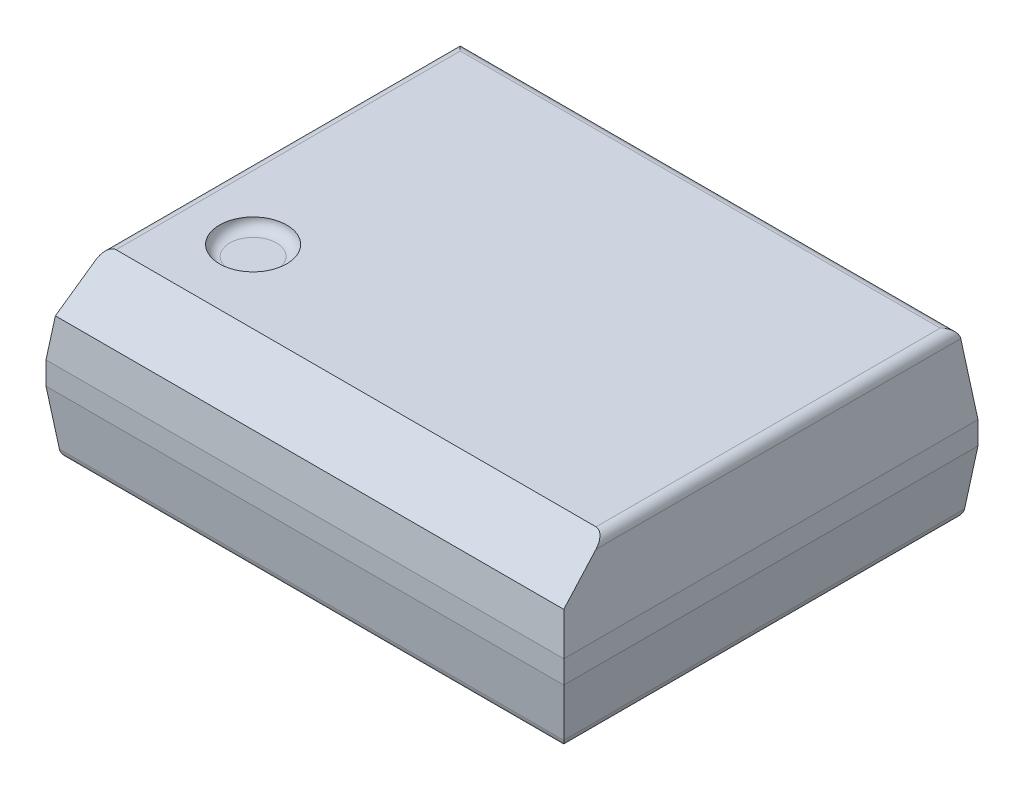
ISO-10303-21;
HEADER;
FILE_DESCRIPTION(('STEP AP214'),'2;1');
FILE_NAME('part.step','',(''),(''),'','','');
FILE_SCHEMA(('AUTOMOTIVE_DESIGN { 1 0 10303 214 1 1 1 1 }'));
ENDSEC;
DATA;
#1=APPLICATION_CONTEXT('core data for automotive mechanical design processes');
#2=APPLICATION_PROTOCOL_DEFINITION('international standard','automotive_design',2000,#1);
#3=PRODUCT_CONTEXT('',#1,'mechanical');
#4=PRODUCT('Part','Part','',(#3));
#5=PRODUCT_RELATED_PRODUCT_CATEGORY('part','',(#4));
#6=PRODUCT_DEFINITION_FORMATION('','',#4);
#7=PRODUCT_DEFINITION_CONTEXT('part definition',#1,'design');
#8=PRODUCT_DEFINITION('design','',#6,#7);
#9=PRODUCT_DEFINITION_SHAPE('','',#8);
#10=(LENGTH_UNIT() NAMED_UNIT(*) SI_UNIT(.MILLI.,.METRE.));
#11=(NAMED_UNIT(*) PLANE_ANGLE_UNIT() SI_UNIT($,.RADIAN.));
#12=(NAMED_UNIT(*) SI_UNIT($,.STERADIAN.) SOLID_ANGLE_UNIT());
#13=UNCERTAINTY_MEASURE_WITH_UNIT(LENGTH_MEASURE(1.E-05),#10,'distance_accuracy_value','');
#14=(GEOMETRIC_REPRESENTATION_CONTEXT(3) GLOBAL_UNCERTAINTY_ASSIGNED_CONTEXT((#13)) GLOBAL_UNIT_ASSIGNED_CONTEXT((#10,
#11,#12)) REPRESENTATION_CONTEXT('',''));
#15=CARTESIAN_POINT('',(0.,0.,0.));
#16=DIRECTION('',(0.,0.,1.));
#17=DIRECTION('',(1.,0.,0.));
#18=AXIS2_PLACEMENT_3D('',#15,#16,#17);
#19=CARTESIAN_POINT('',(-1.7,1.65,0.8));
#20=DIRECTION('',(0.,1.,0.));
#21=DIRECTION('',(0.,0.,1.));
#22=AXIS2_PLACEMENT_3D('',#19,#20,#21);
#23=PLANE('',#22);
#24=CARTESIAN_POINT('',(-1.7,1.65,0.8));
#25=DIRECTION('',(0.,1.,0.));
#26=DIRECTION('',(0.,0.,1.));
#27=AXIS2_PLACEMENT_3D('',#24,#25,#26);
#28=CIRCLE('',#27,0.225000000000001);
#29=CARTESIAN_POINT('',(-1.7,1.65,1.025));
#30=VERTEX_POINT('',#29);
#31=EDGE_CURVE('E20',#30,#30,#28,.T.);
#32=ORIENTED_EDGE('',*,*,#31,.T.);
#33=EDGE_LOOP('',(#32));
#34=FACE_BOUND('',#33,.T.);
#35=ADVANCED_FACE('F16',(#34),#23,.T.);
#36=CARTESIAN_POINT('',(-1.7,1.75,0.8));
#37=DIRECTION('',(0.,1.,0.));
#38=DIRECTION('',(0.,0.,1.));
#39=AXIS2_PLACEMENT_3D('',#36,#37,#38);
#40=TOROIDAL_SURFACE('',#39,0.225000000000001,0.0999999999999994);
#41=ORIENTED_EDGE('',*,*,#31,.F.);
#42=EDGE_LOOP('',(#41));
#43=FACE_BOUND('',#42,.T.);
#44=CARTESIAN_POINT('',(-1.7,1.75,0.8));
#45=DIRECTION('',(0.,1.,0.));
#46=DIRECTION('',(0.,0.,1.));
#47=AXIS2_PLACEMENT_3D('',#44,#45,#46);
#48=CIRCLE('',#47,0.325);
#49=CARTESIAN_POINT('',(-1.7,1.75,1.125));
#50=VERTEX_POINT('',#49);
#51=EDGE_CURVE('E100',#50,#50,#48,.F.);
#52=ORIENTED_EDGE('',*,*,#51,.F.);
#53=EDGE_LOOP('',(#52));
#54=FACE_BOUND('',#53,.T.);
#55=ADVANCED_FACE('F18',(#43,#54),#40,.F.);
#56=CARTESIAN_POINT('',(0.,1.75,0.));
#57=DIRECTION('',(0.,1.,0.));
#58=DIRECTION('',(0.,0.,1.));
#59=AXIS2_PLACEMENT_3D('',#56,#57,#58);
#60=PLANE('',#59);
#61=ORIENTED_EDGE('',*,*,#51,.T.);
#62=EDGE_LOOP('',(#61));
#63=FACE_BOUND('',#62,.T.);
#64=DIRECTION('',(0.,0.,-1.));
#65=VECTOR('',#64,1.);
#66=CARTESIAN_POINT('',(-2.31759728445368,1.75,0.));
#67=LINE('',#66,#65);
#68=CARTESIAN_POINT('',(-2.31759728445368,1.75,1.50606981090928));
#69=VERTEX_POINT('',#68);
#70=CARTESIAN_POINT('',(-2.31759728445368,1.75,-1.81759728445368));
#71=VERTEX_POINT('',#70);
#72=EDGE_CURVE('E92',#69,#71,#67,.T.);
#73=ORIENTED_EDGE('',*,*,#72,.F.);
#74=DIRECTION('',(1.,0.,0.));
#75=VECTOR('',#74,1.);
#76=CARTESIAN_POINT('',(0.,1.75,1.50606981090928));
#77=LINE('',#76,#75);
#78=CARTESIAN_POINT('',(2.31759728445368,1.75,1.50606981090928));
#79=VERTEX_POINT('',#78);
#80=EDGE_CURVE('E80',#79,#69,#77,.F.);
#81=ORIENTED_EDGE('',*,*,#80,.F.);
#82=DIRECTION('',(0.,0.,1.));
#83=VECTOR('',#82,1.);
#84=CARTESIAN_POINT('',(2.31759728445368,1.75,0.));
#85=LINE('',#84,#83);
#86=CARTESIAN_POINT('',(2.31759728445368,1.75,-1.81759728445368));
#87=VERTEX_POINT('',#86);
#88=EDGE_CURVE('E107',#87,#79,#85,.T.);
#89=ORIENTED_EDGE('',*,*,#88,.F.);
#90=DIRECTION('',(1.,0.,0.));
#91=VECTOR('',#90,1.);
#92=CARTESIAN_POINT('',(0.,1.75,-1.81759728445368));
#93=LINE('',#92,#91);
#94=EDGE_CURVE('E96',#71,#87,#93,.T.);
#95=ORIENTED_EDGE('',*,*,#94,.F.);
#96=EDGE_LOOP('',(#73,#81,#89,#95));
#97=FACE_BOUND('',#96,.T.);
#98=ADVANCED_FACE('F95',(#63,#97),#60,.T.);
#99=CARTESIAN_POINT('',(-2.31759728445368,1.65,0.));
#100=DIRECTION('',(0.,0.,-1.));
#101=DIRECTION('',(0.,1.,0.));
#102=AXIS2_PLACEMENT_3D('',#99,#100,#101);
#103=CYLINDRICAL_SURFACE('',#102,0.1);
#104=CARTESIAN_POINT('',(-2.31759728445368,1.65,1.61909924954546));
#105=DIRECTION('',(0.,0.748955720789002,0.662620048215738));
#106=DIRECTION('',(0.,0.662620048215738,-0.748955720789002));
#107=AXIS2_PLACEMENT_3D('',#104,#105,#106);
#108=ELLIPSE('',#107,0.150916049505707,0.1);
#109=CARTESIAN_POINT('',(-2.41685189961781,1.66218693434051,1.60532442607342));
#110=VERTEX_POINT('',#109);
#111=EDGE_CURVE('E86',#69,#110,#108,.T.);
#112=ORIENTED_EDGE('',*,*,#111,.F.);
#113=ORIENTED_EDGE('',*,*,#72,.T.);
#114=CARTESIAN_POINT('',(-2.31759728445368,1.65,-1.81759728445368));
#115=DIRECTION('',(0.707106781186547,0.,-0.707106781186547));
#116=DIRECTION('',(0.707106781186547,0.,0.707106781186547));
#117=AXIS2_PLACEMENT_3D('',#114,#115,#116);
#118=ELLIPSE('',#117,0.14142135623731,0.1);
#119=CARTESIAN_POINT('',(-2.41685189961781,1.66218693434051,-1.91685189961781));
#120=VERTEX_POINT('',#119);
#121=EDGE_CURVE('E441',#120,#71,#118,.T.);
#122=ORIENTED_EDGE('',*,*,#121,.F.);
#123=DIRECTION('',(0.,0.,1.));
#124=VECTOR('',#123,1.);
#125=CARTESIAN_POINT('',(-2.41685189961782,1.66218693434051,0.));
#126=LINE('',#125,#124);
#127=EDGE_CURVE('E104',#110,#120,#126,.F.);
#128=ORIENTED_EDGE('',*,*,#127,.F.);
#129=EDGE_LOOP('',(#112,#113,#122,#128));
#130=FACE_BOUND('',#129,.T.);
#131=ADVANCED_FACE('F103',(#130),#103,.T.);
#132=CARTESIAN_POINT('',(0.,1.55149076967174,1.73044367959031));
#133=DIRECTION('',(0.,0.748955720789002,0.662620048215738));
#134=DIRECTION('',(0.,-0.662620048215738,0.748955720789002));
#135=AXIS2_PLACEMENT_3D('',#132,#133,#134);
#136=PLANE('',#135);
#137=DIRECTION('',(1.,0.,0.));
#138=VECTOR('',#137,1.);
#139=CARTESIAN_POINT('',(0.,1.35298153934347,1.95481754827134));
#140=LINE('',#139,#138);
#141=CARTESIAN_POINT('',(2.45481754827134,1.35298153934347,1.95481754827134));
#142=VERTEX_POINT('',#141);
#143=CARTESIAN_POINT('',(-2.45481754827134,1.35298153934347,1.95481754827134));
#144=VERTEX_POINT('',#143);
#145=EDGE_CURVE('E453',#142,#144,#140,.F.);
#146=ORIENTED_EDGE('',*,*,#145,.F.);
#147=DIRECTION('',(-0.0810915667930045,0.660437812349415,-0.746489151839579));
#148=VECTOR('',#147,1.);
#149=CARTESIAN_POINT('',(2.45481754827134,1.35298153934347,1.95481754827134));
#150=LINE('',#149,#148);
#151=CARTESIAN_POINT('',(2.41685189961781,1.66218693434051,1.60532442607342));
#152=VERTEX_POINT('',#151);
#153=EDGE_CURVE('E105',#142,#152,#150,.T.);
#154=ORIENTED_EDGE('',*,*,#153,.T.);
#155=CARTESIAN_POINT('',(2.31759728445368,1.65,1.61909924954546));
#156=DIRECTION('',(0.,0.748955720789002,0.662620048215738));
#157=DIRECTION('',(0.,-0.662620048215738,0.748955720789002));
#158=AXIS2_PLACEMENT_3D('',#155,#156,#157);
#159=ELLIPSE('',#158,0.150916049505707,0.1);
#160=EDGE_CURVE('E89',#79,#152,#159,.F.);
#161=ORIENTED_EDGE('',*,*,#160,.F.);
#162=ORIENTED_EDGE('',*,*,#80,.T.);
#163=ORIENTED_EDGE('',*,*,#111,.T.);
#164=DIRECTION('',(0.081091566792998,0.660437812349421,-0.746489151839575));
#165=VECTOR('',#164,1.);
#166=CARTESIAN_POINT('',(-2.45481754827134,1.35298153934347,1.95481754827134));
#167=LINE('',#166,#165);
#168=EDGE_CURVE('E464',#144,#110,#167,.T.);
#169=ORIENTED_EDGE('',*,*,#168,.F.);
#170=EDGE_LOOP('',(#146,#154,#161,#162,#163,#169));
#171=FACE_BOUND('',#170,.T.);
#172=ADVANCED_FACE('F83',(#171),#136,.T.);
#173=CARTESIAN_POINT('',(2.31759728445368,1.65,0.));
#174=DIRECTION('',(0.,0.,1.));
#175=DIRECTION('',(0.,-1.,0.));
#176=AXIS2_PLACEMENT_3D('',#173,#174,#175);
#177=CYLINDRICAL_SURFACE('',#176,0.1);
#178=ORIENTED_EDGE('',*,*,#160,.T.);
#179=DIRECTION('',(0.,0.,1.));
#180=VECTOR('',#179,1.);
#181=CARTESIAN_POINT('',(2.41685189961782,1.66218693434051,0.));
#182=LINE('',#181,#180);
#183=CARTESIAN_POINT('',(2.41685189961781,1.66218693434051,-1.91685189961781));
#184=VERTEX_POINT('',#183);
#185=EDGE_CURVE('E439',#184,#152,#182,.T.);
#186=ORIENTED_EDGE('',*,*,#185,.F.);
#187=CARTESIAN_POINT('',(2.31759728445368,1.65,-1.81759728445368));
#188=DIRECTION('',(0.707106781186547,0.,0.707106781186547));
#189=DIRECTION('',(0.707106781186547,0.,-0.707106781186547));
#190=AXIS2_PLACEMENT_3D('',#187,#188,#189);
#191=ELLIPSE('',#190,0.14142135623731,0.1);
#192=EDGE_CURVE('E462',#87,#184,#191,.F.);
#193=ORIENTED_EDGE('',*,*,#192,.F.);
#194=ORIENTED_EDGE('',*,*,#88,.T.);
#195=EDGE_LOOP('',(#178,#186,#193,#194));
#196=FACE_BOUND('',#195,.T.);
#197=ADVANCED_FACE('F200',(#196),#177,.T.);
#198=CARTESIAN_POINT('',(0.,1.65,-1.81759728445368));
#199=DIRECTION('',(1.,0.,0.));
#200=DIRECTION('',(0.,1.,0.));
#201=AXIS2_PLACEMENT_3D('',#198,#199,#200);
#202=CYLINDRICAL_SURFACE('',#201,0.1);
#203=ORIENTED_EDGE('',*,*,#94,.T.);
#204=ORIENTED_EDGE('',*,*,#192,.T.);
#205=DIRECTION('',(1.,0.,0.));
#206=VECTOR('',#205,1.);
#207=CARTESIAN_POINT('',(0.,1.66218693434051,-1.91685189961782));
#208=LINE('',#207,#206);
#209=EDGE_CURVE('E458',#120,#184,#208,.T.);
#210=ORIENTED_EDGE('',*,*,#209,.F.);
#211=ORIENTED_EDGE('',*,*,#121,.T.);
#212=EDGE_LOOP('',(#203,#204,#210,#211));
#213=FACE_BOUND('',#212,.T.);
#214=ADVANCED_FACE('F196',(#213),#202,.T.);
#215=CARTESIAN_POINT('',(-2.45303490545464,1.3675,0.));
#216=DIRECTION('',(-0.992546151641322,0.121869343405147,0.));
#217=DIRECTION('',(-0.121869343405147,-0.992546151641322,0.));
#218=AXIS2_PLACEMENT_3D('',#215,#216,#217);
#219=PLANE('',#218);
#220=DIRECTION('',(0.120974291151357,0.985256536015293,0.120974291151354));
#221=VECTOR('',#220,1.);
#222=CARTESIAN_POINT('',(-2.5,0.985,-2.));
#223=LINE('',#222,#221);
#224=CARTESIAN_POINT('',(-2.5,0.985,-2.));
#225=VERTEX_POINT('',#224);
#226=EDGE_CURVE('E450',#225,#120,#223,.T.);
#227=ORIENTED_EDGE('',*,*,#226,.F.);
#228=DIRECTION('',(0.,0.,1.));
#229=VECTOR('',#228,1.);
#230=CARTESIAN_POINT('',(-2.5,0.985,0.));
#231=LINE('',#230,#229);
#232=CARTESIAN_POINT('',(-2.5,0.985,2.));
#233=VERTEX_POINT('',#232);
#234=EDGE_CURVE('E505',#233,#225,#231,.F.);
#235=ORIENTED_EDGE('',*,*,#234,.F.);
#236=DIRECTION('',(-0.12097429115135,-0.985256536015294,0.120974291151354));
#237=VECTOR('',#236,1.);
#238=CARTESIAN_POINT('',(-2.45481754827134,1.35298153934347,1.95481754827134));
#239=LINE('',#238,#237);
#240=EDGE_CURVE('E448',#144,#233,#239,.T.);
#241=ORIENTED_EDGE('',*,*,#240,.F.);
#242=ORIENTED_EDGE('',*,*,#168,.T.);
#243=ORIENTED_EDGE('',*,*,#127,.T.);
#244=EDGE_LOOP('',(#227,#235,#241,#242,#243));
#245=FACE_BOUND('',#244,.T.);
#246=ADVANCED_FACE('F192',(#245),#219,.T.);
#247=CARTESIAN_POINT('',(0.,1.3675,1.95303490545464));
#248=DIRECTION('',(0.,0.121869343405147,0.992546151641322));
#249=DIRECTION('',(0.,-0.992546151641322,0.121869343405147));
#250=AXIS2_PLACEMENT_3D('',#247,#248,#249);
#251=PLANE('',#250);
#252=ORIENTED_EDGE('',*,*,#145,.T.);
#253=ORIENTED_EDGE('',*,*,#240,.T.);
#254=DIRECTION('',(1.,0.,0.));
#255=VECTOR('',#254,1.);
#256=CARTESIAN_POINT('',(0.,0.985,2.));
#257=LINE('',#256,#255);
#258=CARTESIAN_POINT('',(2.5,0.985,2.));
#259=VERTEX_POINT('',#258);
#260=EDGE_CURVE('E508',#259,#233,#257,.F.);
#261=ORIENTED_EDGE('',*,*,#260,.F.);
#262=DIRECTION('',(0.120974291151354,-0.985256536015294,0.120974291151346));
#263=VECTOR('',#262,1.);
#264=CARTESIAN_POINT('',(2.45481754827134,1.35298153934347,1.95481754827134));
#265=LINE('',#264,#263);
#266=EDGE_CURVE('E447',#142,#259,#265,.T.);
#267=ORIENTED_EDGE('',*,*,#266,.F.);
#268=EDGE_LOOP('',(#252,#253,#261,#267));
#269=FACE_BOUND('',#268,.T.);
#270=ADVANCED_FACE('F188',(#269),#251,.T.);
#271=CARTESIAN_POINT('',(2.45303490545464,1.3675,0.));
#272=DIRECTION('',(0.992546151641322,0.121869343405147,0.));
#273=DIRECTION('',(-0.121869343405147,0.992546151641322,0.));
#274=AXIS2_PLACEMENT_3D('',#271,#272,#273);
#275=PLANE('',#274);
#276=ORIENTED_EDGE('',*,*,#153,.F.);
#277=ORIENTED_EDGE('',*,*,#266,.T.);
#278=DIRECTION('',(0.,0.,-1.));
#279=VECTOR('',#278,1.);
#280=CARTESIAN_POINT('',(2.5,0.985,0.));
#281=LINE('',#280,#279);
#282=CARTESIAN_POINT('',(2.5,0.985,-2.));
#283=VERTEX_POINT('',#282);
#284=EDGE_CURVE('E518',#283,#259,#281,.F.);
#285=ORIENTED_EDGE('',*,*,#284,.F.);
#286=DIRECTION('',(0.120974291151354,-0.985256536015293,-0.120974291151354));
#287=VECTOR('',#286,1.);
#288=CARTESIAN_POINT('',(2.41685189961782,1.66218693434051,-1.91685189961782));
#289=LINE('',#288,#287);
#290=EDGE_CURVE('E446',#184,#283,#289,.T.);
#291=ORIENTED_EDGE('',*,*,#290,.F.);
#292=ORIENTED_EDGE('',*,*,#185,.T.);
#293=EDGE_LOOP('',(#276,#277,#285,#291,#292));
#294=FACE_BOUND('',#293,.T.);
#295=ADVANCED_FACE('F184',(#294),#275,.T.);
#296=CARTESIAN_POINT('',(0.,1.3675,-1.95303490545464));
#297=DIRECTION('',(0.,0.121869343405147,-0.992546151641322));
#298=DIRECTION('',(0.,0.992546151641322,0.121869343405147));
#299=AXIS2_PLACEMENT_3D('',#296,#297,#298);
#300=PLANE('',#299);
#301=ORIENTED_EDGE('',*,*,#209,.T.);
#302=ORIENTED_EDGE('',*,*,#290,.T.);
#303=DIRECTION('',(-1.,0.,0.));
#304=VECTOR('',#303,1.);
#305=CARTESIAN_POINT('',(0.,0.985,-2.));
#306=LINE('',#305,#304);
#307=EDGE_CURVE('E494',#225,#283,#306,.F.);
#308=ORIENTED_EDGE('',*,*,#307,.F.);
#309=ORIENTED_EDGE('',*,*,#226,.T.);
#310=EDGE_LOOP('',(#301,#302,#308,#309));
#311=FACE_BOUND('',#310,.T.);
#312=ADVANCED_FACE('F180',(#311),#300,.T.);
#313=CARTESIAN_POINT('',(-2.5,0.15,0.));
#314=DIRECTION('',(-1.,0.,0.));
#315=DIRECTION('',(0.,0.,1.));
#316=AXIS2_PLACEMENT_3D('',#313,#314,#315);
#317=PLANE('',#316);
#318=DIRECTION('',(0.,0.,1.));
#319=VECTOR('',#318,1.);
#320=CARTESIAN_POINT('',(-2.5,0.764999999999999,0.));
#321=LINE('',#320,#319);
#322=CARTESIAN_POINT('',(-2.5,0.764999999999999,2.));
#323=VERTEX_POINT('',#322);
#324=CARTESIAN_POINT('',(-2.5,0.765,-2.));
#325=VERTEX_POINT('',#324);
#326=EDGE_CURVE('E550',#323,#325,#321,.F.);
#327=ORIENTED_EDGE('',*,*,#326,.F.);
#328=DIRECTION('',(0.,1.,0.));
#329=VECTOR('',#328,1.);
#330=CARTESIAN_POINT('',(-2.5,0.15,2.));
#331=LINE('',#330,#329);
#332=EDGE_CURVE('E511',#233,#323,#331,.F.);
#333=ORIENTED_EDGE('',*,*,#332,.F.);
#334=ORIENTED_EDGE('',*,*,#234,.T.);
#335=DIRECTION('',(0.,1.,0.));
#336=VECTOR('',#335,1.);
#337=CARTESIAN_POINT('',(-2.5,0.15,-2.));
#338=LINE('',#337,#336);
#339=EDGE_CURVE('E555',#325,#225,#338,.T.);
#340=ORIENTED_EDGE('',*,*,#339,.F.);
#341=EDGE_LOOP('',(#327,#333,#334,#340));
#342=FACE_BOUND('',#341,.T.);
#343=ADVANCED_FACE('F176',(#342),#317,.T.);
#344=CARTESIAN_POINT('',(0.,0.15,2.));
#345=DIRECTION('',(0.,0.,1.));
#346=DIRECTION('',(1.,0.,0.));
#347=AXIS2_PLACEMENT_3D('',#344,#345,#346);
#348=PLANE('',#347);
#349=DIRECTION('',(1.,0.,0.));
#350=VECTOR('',#349,1.);
#351=CARTESIAN_POINT('',(0.,0.764999999999999,2.));
#352=LINE('',#351,#350);
#353=CARTESIAN_POINT('',(2.5,0.765,2.));
#354=VERTEX_POINT('',#353);
#355=EDGE_CURVE('E546',#354,#323,#352,.F.);
#356=ORIENTED_EDGE('',*,*,#355,.F.);
#357=DIRECTION('',(0.,1.,0.));
#358=VECTOR('',#357,1.);
#359=CARTESIAN_POINT('',(2.5,0.15,2.));
#360=LINE('',#359,#358);
#361=EDGE_CURVE('E531',#259,#354,#360,.F.);
#362=ORIENTED_EDGE('',*,*,#361,.F.);
#363=ORIENTED_EDGE('',*,*,#260,.T.);
#364=ORIENTED_EDGE('',*,*,#332,.T.);
#365=EDGE_LOOP('',(#356,#362,#363,#364));
#366=FACE_BOUND('',#365,.T.);
#367=ADVANCED_FACE('F172',(#366),#348,.T.);
#368=CARTESIAN_POINT('',(2.5,0.15,0.));
#369=DIRECTION('',(1.,0.,0.));
#370=DIRECTION('',(0.,0.,-1.));
#371=AXIS2_PLACEMENT_3D('',#368,#369,#370);
#372=PLANE('',#371);
#373=DIRECTION('',(0.,0.,1.));
#374=VECTOR('',#373,1.);
#375=CARTESIAN_POINT('',(2.5,0.765,0.));
#376=LINE('',#375,#374);
#377=CARTESIAN_POINT('',(2.5,0.765,-2.));
#378=VERTEX_POINT('',#377);
#379=EDGE_CURVE('E561',#378,#354,#376,.T.);
#380=ORIENTED_EDGE('',*,*,#379,.F.);
#381=DIRECTION('',(0.,1.,0.));
#382=VECTOR('',#381,1.);
#383=CARTESIAN_POINT('',(2.5,0.15,-2.));
#384=LINE('',#383,#382);
#385=EDGE_CURVE('E530',#283,#378,#384,.F.);
#386=ORIENTED_EDGE('',*,*,#385,.F.);
#387=ORIENTED_EDGE('',*,*,#284,.T.);
#388=ORIENTED_EDGE('',*,*,#361,.T.);
#389=EDGE_LOOP('',(#380,#386,#387,#388));
#390=FACE_BOUND('',#389,.T.);
#391=ADVANCED_FACE('F168',(#390),#372,.T.);
#392=CARTESIAN_POINT('',(0.,0.15,-2.));
#393=DIRECTION('',(0.,0.,-1.));
#394=DIRECTION('',(-1.,0.,0.));
#395=AXIS2_PLACEMENT_3D('',#392,#393,#394);
#396=PLANE('',#395);
#397=DIRECTION('',(1.,0.,0.));
#398=VECTOR('',#397,1.);
#399=CARTESIAN_POINT('',(0.,0.764999999999999,-2.));
#400=LINE('',#399,#398);
#401=EDGE_CURVE('E566',#325,#378,#400,.T.);
#402=ORIENTED_EDGE('',*,*,#401,.F.);
#403=ORIENTED_EDGE('',*,*,#339,.T.);
#404=ORIENTED_EDGE('',*,*,#307,.T.);
#405=ORIENTED_EDGE('',*,*,#385,.T.);
#406=EDGE_LOOP('',(#402,#403,#404,#405));
#407=FACE_BOUND('',#406,.T.);
#408=ADVANCED_FACE('F164',(#407),#396,.T.);
#409=CARTESIAN_POINT('',(-2.46224374752236,0.4575,0.));
#410=DIRECTION('',(-0.992546151641322,-0.121869343405147,0.));
#411=DIRECTION('',(0.121869343405147,-0.992546151641322,0.));
#412=AXIS2_PLACEMENT_3D('',#409,#410,#411);
#413=PLANE('',#412);
#414=DIRECTION('',(0.,0.,1.));
#415=VECTOR('',#414,1.);
#416=CARTESIAN_POINT('',(-2.43526958375325,0.237813065659485,0.));
#417=LINE('',#416,#415);
#418=CARTESIAN_POINT('',(-2.43526958375325,0.237813065659485,1.93526958375325));
#419=VERTEX_POINT('',#418);
#420=CARTESIAN_POINT('',(-2.43526958375325,0.237813065659485,-1.93526958375325));
#421=VERTEX_POINT('',#420);
#422=EDGE_CURVE('E589',#419,#421,#417,.F.);
#423=ORIENTED_EDGE('',*,*,#422,.F.);
#424=DIRECTION('',(0.120974291151353,-0.985256536015293,-0.120974291151354));
#425=VECTOR('',#424,1.);
#426=CARTESIAN_POINT('',(-2.5,0.764999999999999,2.));
#427=LINE('',#426,#425);
#428=EDGE_CURVE('E549',#323,#419,#427,.T.);
#429=ORIENTED_EDGE('',*,*,#428,.F.);
#430=ORIENTED_EDGE('',*,*,#326,.T.);
#431=DIRECTION('',(-0.120974291151354,0.985256536015293,-0.120974291151354));
#432=VECTOR('',#431,1.);
#433=CARTESIAN_POINT('',(-2.43526958375325,0.237813065659484,-1.93526958375325));
#434=LINE('',#433,#432);
#435=EDGE_CURVE('E584',#421,#325,#434,.T.);
#436=ORIENTED_EDGE('',*,*,#435,.F.);
#437=EDGE_LOOP('',(#423,#429,#430,#436));
#438=FACE_BOUND('',#437,.T.);
#439=ADVANCED_FACE('F160',(#438),#413,.T.);
#440=CARTESIAN_POINT('',(0.,0.4575,1.96224374752236));
#441=DIRECTION('',(0.,-0.121869343405147,0.992546151641322));
#442=DIRECTION('',(0.,-0.992546151641322,-0.121869343405147));
#443=AXIS2_PLACEMENT_3D('',#440,#441,#442);
#444=PLANE('',#443);
#445=DIRECTION('',(1.,0.,0.));
#446=VECTOR('',#445,1.);
#447=CARTESIAN_POINT('',(0.,0.237813065659485,1.93526958375325));
#448=LINE('',#447,#446);
#449=CARTESIAN_POINT('',(2.43526958375325,0.237813065659485,1.93526958375325));
#450=VERTEX_POINT('',#449);
#451=EDGE_CURVE('E486',#450,#419,#448,.F.);
#452=ORIENTED_EDGE('',*,*,#451,.F.);
#453=DIRECTION('',(-0.120974291151354,-0.985256536015293,-0.120974291151356));
#454=VECTOR('',#453,1.);
#455=CARTESIAN_POINT('',(2.5,0.765,2.));
#456=LINE('',#455,#454);
#457=EDGE_CURVE('E563',#354,#450,#456,.T.);
#458=ORIENTED_EDGE('',*,*,#457,.F.);
#459=ORIENTED_EDGE('',*,*,#355,.T.);
#460=ORIENTED_EDGE('',*,*,#428,.T.);
#461=EDGE_LOOP('',(#452,#458,#459,#460));
#462=FACE_BOUND('',#461,.T.);
#463=ADVANCED_FACE('F156',(#462),#444,.T.);
#464=CARTESIAN_POINT('',(2.46224374752236,0.4575,0.));
#465=DIRECTION('',(0.992546151641322,-0.121869343405147,0.));
#466=DIRECTION('',(0.121869343405147,0.992546151641322,0.));
#467=AXIS2_PLACEMENT_3D('',#464,#465,#466);
#468=PLANE('',#467);
#469=DIRECTION('',(0.,0.,-1.));
#470=VECTOR('',#469,1.);
#471=CARTESIAN_POINT('',(2.43526958375325,0.237813065659485,0.));
#472=LINE('',#471,#470);
#473=CARTESIAN_POINT('',(2.43526958375325,0.237813065659485,-1.93526958375325));
#474=VERTEX_POINT('',#473);
#475=EDGE_CURVE('E483',#474,#450,#472,.F.);
#476=ORIENTED_EDGE('',*,*,#475,.F.);
#477=DIRECTION('',(-0.120974291151356,-0.985256536015293,0.120974291151354));
#478=VECTOR('',#477,1.);
#479=CARTESIAN_POINT('',(2.5,0.765,-2.));
#480=LINE('',#479,#478);
#481=EDGE_CURVE('E569',#378,#474,#480,.T.);
#482=ORIENTED_EDGE('',*,*,#481,.F.);
#483=ORIENTED_EDGE('',*,*,#379,.T.);
#484=ORIENTED_EDGE('',*,*,#457,.T.);
#485=EDGE_LOOP('',(#476,#482,#483,#484));
#486=FACE_BOUND('',#485,.T.);
#487=ADVANCED_FACE('F152',(#486),#468,.T.);
#488=CARTESIAN_POINT('',(0.,0.4575,-1.96224374752236));
#489=DIRECTION('',(0.,-0.121869343405147,-0.992546151641322));
#490=DIRECTION('',(0.,0.992546151641322,-0.121869343405147));
#491=AXIS2_PLACEMENT_3D('',#488,#489,#490);
#492=PLANE('',#491);
#493=DIRECTION('',(-1.,0.,0.));
#494=VECTOR('',#493,1.);
#495=CARTESIAN_POINT('',(0.,0.237813065659485,-1.93526958375325));
#496=LINE('',#495,#494);
#497=EDGE_CURVE('E480',#421,#474,#496,.F.);
#498=ORIENTED_EDGE('',*,*,#497,.F.);
#499=ORIENTED_EDGE('',*,*,#435,.T.);
#500=ORIENTED_EDGE('',*,*,#401,.T.);
#501=ORIENTED_EDGE('',*,*,#481,.T.);
#502=EDGE_LOOP('',(#498,#499,#500,#501));
#503=FACE_BOUND('',#502,.T.);
#504=ADVANCED_FACE('F148',(#503),#492,.T.);
#505=CARTESIAN_POINT('',(-2.33601496858912,0.25,0.));
#506=DIRECTION('',(0.,0.,1.));
#507=DIRECTION('',(0.,-1.,0.));
#508=AXIS2_PLACEMENT_3D('',#505,#506,#507);
#509=CYLINDRICAL_SURFACE('',#508,0.1);
#510=DIRECTION('',(0.,0.,1.));
#511=VECTOR('',#510,1.);
#512=CARTESIAN_POINT('',(-2.33601496858912,0.15,0.));
#513=LINE('',#512,#511);
#514=CARTESIAN_POINT('',(-2.33601496858912,0.15,-1.83601496858912));
#515=VERTEX_POINT('',#514);
#516=CARTESIAN_POINT('',(-2.33601496858912,0.15,1.83601496858912));
#517=VERTEX_POINT('',#516);
#518=EDGE_CURVE('E478',#515,#517,#513,.T.);
#519=ORIENTED_EDGE('',*,*,#518,.T.);
#520=CARTESIAN_POINT('',(-2.33601496858912,0.25,1.83601496858912));
#521=DIRECTION('',(0.707106781186547,0.,0.707106781186547));
#522=DIRECTION('',(0.707106781186547,0.,-0.707106781186547));
#523=AXIS2_PLACEMENT_3D('',#520,#521,#522);
#524=ELLIPSE('',#523,0.14142135623731,0.1);
#525=EDGE_CURVE('E484',#419,#517,#524,.T.);
#526=ORIENTED_EDGE('',*,*,#525,.F.);
#527=ORIENTED_EDGE('',*,*,#422,.T.);
#528=CARTESIAN_POINT('',(-2.33601496858912,0.25,-1.83601496858912));
#529=DIRECTION('',(-0.707106781186547,0.,0.707106781186547));
#530=DIRECTION('',(-0.707106781186547,0.,-0.707106781186547));
#531=AXIS2_PLACEMENT_3D('',#528,#529,#530);
#532=ELLIPSE('',#531,0.14142135623731,0.1);
#533=EDGE_CURVE('E475',#515,#421,#532,.F.);
#534=ORIENTED_EDGE('',*,*,#533,.F.);
#535=EDGE_LOOP('',(#519,#526,#527,#534));
#536=FACE_BOUND('',#535,.T.);
#537=ADVANCED_FACE('F144',(#536),#509,.T.);
#538=CARTESIAN_POINT('',(0.,0.25,1.83601496858912));
#539=DIRECTION('',(1.,0.,0.));
#540=DIRECTION('',(0.,1.,0.));
#541=AXIS2_PLACEMENT_3D('',#538,#539,#540);
#542=CYLINDRICAL_SURFACE('',#541,0.1);
#543=DIRECTION('',(1.,0.,0.));
#544=VECTOR('',#543,1.);
#545=CARTESIAN_POINT('',(0.,0.15,1.83601496858912));
#546=LINE('',#545,#544);
#547=CARTESIAN_POINT('',(2.33601496858912,0.15,1.83601496858912));
#548=VERTEX_POINT('',#547);
#549=EDGE_CURVE('E594',#517,#548,#546,.T.);
#550=ORIENTED_EDGE('',*,*,#549,.T.);
#551=CARTESIAN_POINT('',(2.33601496858912,0.25,1.83601496858912));
#552=DIRECTION('',(0.707106781186547,0.,-0.707106781186547));
#553=DIRECTION('',(-0.707106781186547,0.,-0.707106781186547));
#554=AXIS2_PLACEMENT_3D('',#551,#552,#553);
#555=ELLIPSE('',#554,0.14142135623731,0.1);
#556=EDGE_CURVE('E481',#450,#548,#555,.T.);
#557=ORIENTED_EDGE('',*,*,#556,.F.);
#558=ORIENTED_EDGE('',*,*,#451,.T.);
#559=ORIENTED_EDGE('',*,*,#525,.T.);
#560=EDGE_LOOP('',(#550,#557,#558,#559));
#561=FACE_BOUND('',#560,.T.);
#562=ADVANCED_FACE('F140',(#561),#542,.T.);
#563=CARTESIAN_POINT('',(2.33601496858912,0.25,0.));
#564=DIRECTION('',(0.,0.,-1.));
#565=DIRECTION('',(0.,1.,0.));
#566=AXIS2_PLACEMENT_3D('',#563,#564,#565);
#567=CYLINDRICAL_SURFACE('',#566,0.1);
#568=DIRECTION('',(0.,0.,1.));
#569=VECTOR('',#568,1.);
#570=CARTESIAN_POINT('',(2.33601496858912,0.15,0.));
#571=LINE('',#570,#569);
#572=CARTESIAN_POINT('',(2.33601496858912,0.15,-1.83601496858912));
#573=VERTEX_POINT('',#572);
#574=EDGE_CURVE('E26',#548,#573,#571,.F.);
#575=ORIENTED_EDGE('',*,*,#574,.T.);
#576=CARTESIAN_POINT('',(2.33601496858912,0.25,-1.83601496858912));
#577=DIRECTION('',(-0.707106781186547,0.,-0.707106781186547));
#578=DIRECTION('',(-0.707106781186547,0.,0.707106781186547));
#579=AXIS2_PLACEMENT_3D('',#576,#577,#578);
#580=ELLIPSE('',#579,0.14142135623731,0.1);
#581=EDGE_CURVE('E34',#474,#573,#580,.T.);
#582=ORIENTED_EDGE('',*,*,#581,.F.);
#583=ORIENTED_EDGE('',*,*,#475,.T.);
#584=ORIENTED_EDGE('',*,*,#556,.T.);
#585=EDGE_LOOP('',(#575,#582,#583,#584));
#586=FACE_BOUND('',#585,.T.);
#587=ADVANCED_FACE('F134',(#586),#567,.T.);
#588=CARTESIAN_POINT('',(0.,0.25,-1.83601496858912));
#589=DIRECTION('',(-1.,0.,0.));
#590=DIRECTION('',(0.,-1.,0.));
#591=AXIS2_PLACEMENT_3D('',#588,#589,#590);
#592=CYLINDRICAL_SURFACE('',#591,0.1);
#593=DIRECTION('',(1.,0.,0.));
#594=VECTOR('',#593,1.);
#595=CARTESIAN_POINT('',(0.,0.15,-1.83601496858912));
#596=LINE('',#595,#594);
#597=EDGE_CURVE('E11',#573,#515,#596,.F.);
#598=ORIENTED_EDGE('',*,*,#597,.T.);
#599=ORIENTED_EDGE('',*,*,#533,.T.);
#600=ORIENTED_EDGE('',*,*,#497,.T.);
#601=ORIENTED_EDGE('',*,*,#581,.T.);
#602=EDGE_LOOP('',(#598,#599,#600,#601));
#603=FACE_BOUND('',#602,.T.);
#604=ADVANCED_FACE('F128',(#603),#592,.T.);
#605=CARTESIAN_POINT('',(0.,0.15,0.));
#606=DIRECTION('',(0.,1.,0.));
#607=DIRECTION('',(0.,0.,1.));
#608=AXIS2_PLACEMENT_3D('',#605,#606,#607);
#609=PLANE('',#608);
#610=ORIENTED_EDGE('',*,*,#574,.F.);
#611=ORIENTED_EDGE('',*,*,#549,.F.);
#612=ORIENTED_EDGE('',*,*,#518,.F.);
#613=ORIENTED_EDGE('',*,*,#597,.F.);
#614=EDGE_LOOP('',(#610,#611,#612,#613));
#615=FACE_BOUND('',#614,.T.);
#616=ADVANCED_FACE('F126',(#615),#609,.F.);
#617=CLOSED_SHELL('',(#35,#55,#98,#131,#172,#197,#214,#246,#270,#295,#312,#343,#367,#391,#408,
#439,#463,#487,#504,#537,#562,#587,#604,#616));
#618=MANIFOLD_SOLID_BREP('B1',#617);
#619=ADVANCED_BREP_SHAPE_REPRESENTATION('',(#18,#618),#14);
#620=SHAPE_DEFINITION_REPRESENTATION(#9,#619);
ENDSEC;
END-ISO-10303-21;
